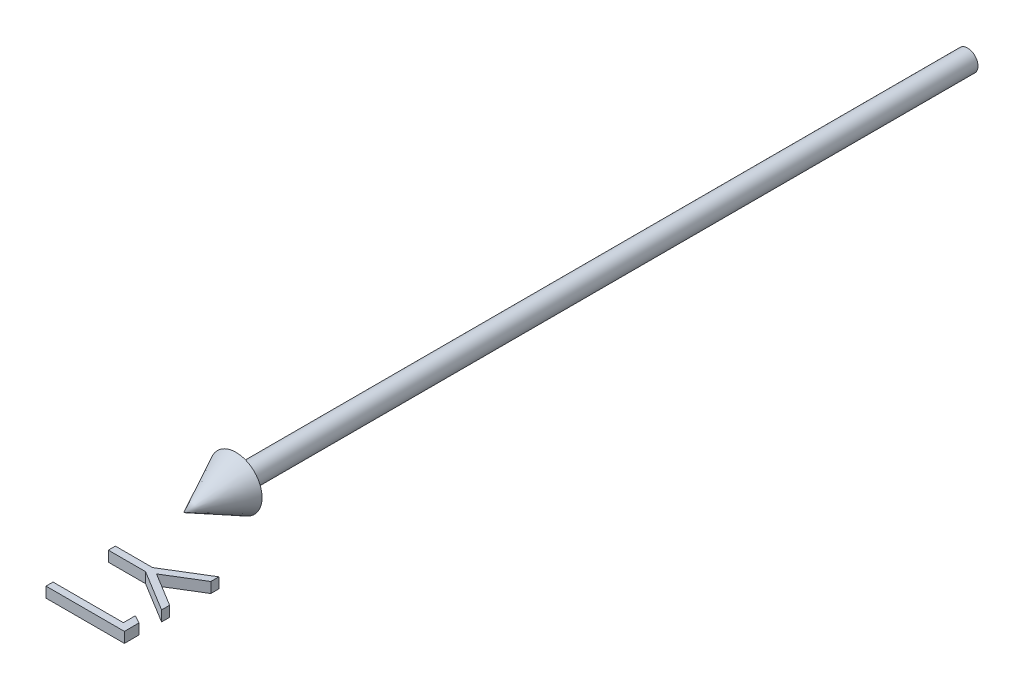
ISO-10303-21;
HEADER;
FILE_DESCRIPTION(('STEP AP214'),'2;1');
FILE_NAME('part.step','',(''),(''),'','','');
FILE_SCHEMA(('AUTOMOTIVE_DESIGN { 1 0 10303 214 1 1 1 1 }'));
ENDSEC;
DATA;
#1=APPLICATION_CONTEXT('core data for automotive mechanical design processes');
#2=APPLICATION_PROTOCOL_DEFINITION('international standard','automotive_design',2000,#1);
#3=PRODUCT_CONTEXT('',#1,'mechanical');
#4=PRODUCT('Part','Part','',(#3));
#5=PRODUCT_RELATED_PRODUCT_CATEGORY('part','',(#4));
#6=PRODUCT_DEFINITION_FORMATION('','',#4);
#7=PRODUCT_DEFINITION_CONTEXT('part definition',#1,'design');
#8=PRODUCT_DEFINITION('design','',#6,#7);
#9=PRODUCT_DEFINITION_SHAPE('','',#8);
#10=(LENGTH_UNIT() NAMED_UNIT(*) SI_UNIT(.MILLI.,.METRE.));
#11=(NAMED_UNIT(*) PLANE_ANGLE_UNIT() SI_UNIT($,.RADIAN.));
#12=(NAMED_UNIT(*) SI_UNIT($,.STERADIAN.) SOLID_ANGLE_UNIT());
#13=UNCERTAINTY_MEASURE_WITH_UNIT(LENGTH_MEASURE(1.E-05),#10,'distance_accuracy_value','');
#14=(GEOMETRIC_REPRESENTATION_CONTEXT(3) GLOBAL_UNCERTAINTY_ASSIGNED_CONTEXT((#13)) GLOBAL_UNIT_ASSIGNED_CONTEXT((#10,
#11,#12)) REPRESENTATION_CONTEXT('',''));
#15=CARTESIAN_POINT('',(0.,0.,0.));
#16=DIRECTION('',(0.,0.,1.));
#17=DIRECTION('',(1.,0.,0.));
#18=AXIS2_PLACEMENT_3D('',#15,#16,#17);
#19=CARTESIAN_POINT('',(13.4615384615385,1.,172.692307692308));
#20=DIRECTION('',(0.496686511837692,0.,-0.867930013859704));
#21=DIRECTION('',(-0.867930013859704,0.,-0.496686511837692));
#22=AXIS2_PLACEMENT_3D('',#19,#20,#21);
#23=PLANE('',#22);
#24=DIRECTION('',(0.,-1.,0.));
#25=VECTOR('',#24,1.);
#26=CARTESIAN_POINT('',(15.,1.,173.572716346154));
#27=LINE('',#26,#25);
#28=CARTESIAN_POINT('',(15.,1.,173.572716346154));
#29=VERTEX_POINT('',#28);
#30=CARTESIAN_POINT('',(15.,-1.,173.572716346154));
#31=VERTEX_POINT('',#30);
#32=EDGE_CURVE('E49',#29,#31,#27,.T.);
#33=ORIENTED_EDGE('',*,*,#32,.T.);
#34=DIRECTION('',(0.867930013859704,0.,0.496686511837692));
#35=VECTOR('',#34,1.);
#36=CARTESIAN_POINT('',(13.4615384615385,-1.,172.692307692308));
#37=LINE('',#36,#35);
#38=CARTESIAN_POINT('',(13.4615384615385,-1.,172.692307692308));
#39=VERTEX_POINT('',#38);
#40=EDGE_CURVE('E98',#39,#31,#37,.T.);
#41=ORIENTED_EDGE('',*,*,#40,.F.);
#42=DIRECTION('',(0.,-1.,0.));
#43=VECTOR('',#42,1.);
#44=CARTESIAN_POINT('',(13.4615384615385,1.,172.692307692308));
#45=LINE('',#44,#43);
#46=CARTESIAN_POINT('',(13.4615384615385,1.,172.692307692308));
#47=VERTEX_POINT('',#46);
#48=EDGE_CURVE('E12',#47,#39,#45,.T.);
#49=ORIENTED_EDGE('',*,*,#48,.F.);
#50=DIRECTION('',(0.867930013859704,0.,0.496686511837692));
#51=VECTOR('',#50,1.);
#52=CARTESIAN_POINT('',(13.4615384615385,1.,172.692307692308));
#53=LINE('',#52,#51);
#54=EDGE_CURVE('E99',#47,#29,#53,.T.);
#55=ORIENTED_EDGE('',*,*,#54,.T.);
#56=EDGE_LOOP('',(#33,#41,#49,#55));
#57=FACE_BOUND('',#56,.T.);
#58=ADVANCED_FACE('F46',(#57),#23,.T.);
#59=CARTESIAN_POINT('',(13.4615384615385,1.,175.));
#60=DIRECTION('',(-1.,0.,0.));
#61=DIRECTION('',(0.,0.,1.));
#62=AXIS2_PLACEMENT_3D('',#59,#60,#61);
#63=PLANE('',#62);
#64=ORIENTED_EDGE('',*,*,#48,.T.);
#65=DIRECTION('',(0.,0.,-1.));
#66=VECTOR('',#65,1.);
#67=CARTESIAN_POINT('',(13.4615384615385,-1.,175.));
#68=LINE('',#67,#66);
#69=CARTESIAN_POINT('',(13.4615384615385,-1.,175.));
#70=VERTEX_POINT('',#69);
#71=EDGE_CURVE('E116',#70,#39,#68,.T.);
#72=ORIENTED_EDGE('',*,*,#71,.F.);
#73=DIRECTION('',(0.,-1.,0.));
#74=VECTOR('',#73,1.);
#75=CARTESIAN_POINT('',(13.4615384615385,1.,175.));
#76=LINE('',#75,#74);
#77=CARTESIAN_POINT('',(13.4615384615385,1.,175.));
#78=VERTEX_POINT('',#77);
#79=EDGE_CURVE('E54',#78,#70,#76,.T.);
#80=ORIENTED_EDGE('',*,*,#79,.F.);
#81=DIRECTION('',(0.,0.,-1.));
#82=VECTOR('',#81,1.);
#83=CARTESIAN_POINT('',(13.4615384615385,1.,175.));
#84=LINE('',#83,#82);
#85=EDGE_CURVE('E104',#78,#47,#84,.T.);
#86=ORIENTED_EDGE('',*,*,#85,.T.);
#87=EDGE_LOOP('',(#64,#72,#80,#86));
#88=FACE_BOUND('',#87,.T.);
#89=ADVANCED_FACE('F156',(#88),#63,.T.);
#90=CARTESIAN_POINT('',(0.,1.,175.));
#91=DIRECTION('',(0.,0.,-1.));
#92=DIRECTION('',(-1.,0.,0.));
#93=AXIS2_PLACEMENT_3D('',#90,#91,#92);
#94=PLANE('',#93);
#95=ORIENTED_EDGE('',*,*,#79,.T.);
#96=DIRECTION('',(1.,0.,0.));
#97=VECTOR('',#96,1.);
#98=CARTESIAN_POINT('',(0.,-1.,175.));
#99=LINE('',#98,#97);
#100=CARTESIAN_POINT('',(0.,-1.,175.));
#101=VERTEX_POINT('',#100);
#102=EDGE_CURVE('E123',#101,#70,#99,.T.);
#103=ORIENTED_EDGE('',*,*,#102,.F.);
#104=DIRECTION('',(0.,-1.,0.));
#105=VECTOR('',#104,1.);
#106=CARTESIAN_POINT('',(0.,1.,175.));
#107=LINE('',#106,#105);
#108=CARTESIAN_POINT('',(0.,1.,175.));
#109=VERTEX_POINT('',#108);
#110=EDGE_CURVE('E139',#109,#101,#107,.T.);
#111=ORIENTED_EDGE('',*,*,#110,.F.);
#112=DIRECTION('',(1.,0.,0.));
#113=VECTOR('',#112,1.);
#114=CARTESIAN_POINT('',(0.,1.,175.));
#115=LINE('',#114,#113);
#116=EDGE_CURVE('E135',#109,#78,#115,.T.);
#117=ORIENTED_EDGE('',*,*,#116,.T.);
#118=EDGE_LOOP('',(#95,#103,#111,#117));
#119=FACE_BOUND('',#118,.T.);
#120=ADVANCED_FACE('F152',(#119),#94,.T.);
#121=CARTESIAN_POINT('',(0.,1.,176.346153846154));
#122=DIRECTION('',(-1.,0.,0.));
#123=DIRECTION('',(0.,0.,1.));
#124=AXIS2_PLACEMENT_3D('',#121,#122,#123);
#125=PLANE('',#124);
#126=ORIENTED_EDGE('',*,*,#110,.T.);
#127=DIRECTION('',(0.,0.,-1.));
#128=VECTOR('',#127,1.);
#129=CARTESIAN_POINT('',(0.,-1.,176.346153846154));
#130=LINE('',#129,#128);
#131=CARTESIAN_POINT('',(0.,-1.,176.346153846154));
#132=VERTEX_POINT('',#131);
#133=EDGE_CURVE('E120',#132,#101,#130,.T.);
#134=ORIENTED_EDGE('',*,*,#133,.F.);
#135=DIRECTION('',(0.,-1.,0.));
#136=VECTOR('',#135,1.);
#137=CARTESIAN_POINT('',(0.,1.,176.346153846154));
#138=LINE('',#137,#136);
#139=CARTESIAN_POINT('',(0.,1.,176.346153846154));
#140=VERTEX_POINT('',#139);
#141=EDGE_CURVE('E141',#140,#132,#138,.T.);
#142=ORIENTED_EDGE('',*,*,#141,.F.);
#143=DIRECTION('',(0.,0.,-1.));
#144=VECTOR('',#143,1.);
#145=CARTESIAN_POINT('',(0.,1.,176.346153846154));
#146=LINE('',#145,#144);
#147=EDGE_CURVE('E132',#140,#109,#146,.T.);
#148=ORIENTED_EDGE('',*,*,#147,.T.);
#149=EDGE_LOOP('',(#126,#134,#142,#148));
#150=FACE_BOUND('',#149,.T.);
#151=ADVANCED_FACE('F149',(#150),#125,.T.);
#152=CARTESIAN_POINT('',(15.,1.,176.346153846154));
#153=DIRECTION('',(0.,0.,1.));
#154=DIRECTION('',(1.,0.,0.));
#155=AXIS2_PLACEMENT_3D('',#152,#153,#154);
#156=PLANE('',#155);
#157=ORIENTED_EDGE('',*,*,#141,.T.);
#158=DIRECTION('',(-1.,0.,0.));
#159=VECTOR('',#158,1.);
#160=CARTESIAN_POINT('',(15.,-1.,176.346153846154));
#161=LINE('',#160,#159);
#162=CARTESIAN_POINT('',(15.,-1.,176.346153846154));
#163=VERTEX_POINT('',#162);
#164=EDGE_CURVE('E111',#163,#132,#161,.T.);
#165=ORIENTED_EDGE('',*,*,#164,.F.);
#166=DIRECTION('',(0.,-1.,0.));
#167=VECTOR('',#166,1.);
#168=CARTESIAN_POINT('',(15.,1.,176.346153846154));
#169=LINE('',#168,#167);
#170=CARTESIAN_POINT('',(15.,1.,176.346153846154));
#171=VERTEX_POINT('',#170);
#172=EDGE_CURVE('E103',#171,#163,#169,.T.);
#173=ORIENTED_EDGE('',*,*,#172,.F.);
#174=DIRECTION('',(-1.,0.,0.));
#175=VECTOR('',#174,1.);
#176=CARTESIAN_POINT('',(15.,1.,176.346153846154));
#177=LINE('',#176,#175);
#178=EDGE_CURVE('E129',#171,#140,#177,.T.);
#179=ORIENTED_EDGE('',*,*,#178,.T.);
#180=EDGE_LOOP('',(#157,#165,#173,#179));
#181=FACE_BOUND('',#180,.T.);
#182=ADVANCED_FACE('F143',(#181),#156,.T.);
#183=CARTESIAN_POINT('',(15.,1.,173.572716346154));
#184=DIRECTION('',(1.,0.,0.));
#185=DIRECTION('',(0.,0.,-1.));
#186=AXIS2_PLACEMENT_3D('',#183,#184,#185);
#187=PLANE('',#186);
#188=ORIENTED_EDGE('',*,*,#172,.T.);
#189=DIRECTION('',(0.,0.,1.));
#190=VECTOR('',#189,1.);
#191=CARTESIAN_POINT('',(15.,-1.,173.572716346154));
#192=LINE('',#191,#190);
#193=EDGE_CURVE('E106',#31,#163,#192,.T.);
#194=ORIENTED_EDGE('',*,*,#193,.F.);
#195=ORIENTED_EDGE('',*,*,#32,.F.);
#196=DIRECTION('',(0.,0.,1.));
#197=VECTOR('',#196,1.);
#198=CARTESIAN_POINT('',(15.,1.,173.572716346154));
#199=LINE('',#198,#197);
#200=EDGE_CURVE('E127',#29,#171,#199,.T.);
#201=ORIENTED_EDGE('',*,*,#200,.T.);
#202=EDGE_LOOP('',(#188,#194,#195,#201));
#203=FACE_BOUND('',#202,.T.);
#204=ADVANCED_FACE('F107',(#203),#187,.T.);
#205=CARTESIAN_POINT('',(0.,1.,0.));
#206=DIRECTION('',(0.,-1.,0.));
#207=DIRECTION('',(0.,0.,-1.));
#208=AXIS2_PLACEMENT_3D('',#205,#206,#207);
#209=PLANE('',#208);
#210=ORIENTED_EDGE('',*,*,#54,.F.);
#211=ORIENTED_EDGE('',*,*,#85,.F.);
#212=ORIENTED_EDGE('',*,*,#116,.F.);
#213=ORIENTED_EDGE('',*,*,#147,.F.);
#214=ORIENTED_EDGE('',*,*,#178,.F.);
#215=ORIENTED_EDGE('',*,*,#200,.F.);
#216=EDGE_LOOP('',(#210,#211,#212,#213,#214,#215));
#217=FACE_BOUND('',#216,.T.);
#218=ADVANCED_FACE('F155',(#217),#209,.F.);
#219=CARTESIAN_POINT('',(0.,-1.,0.));
#220=DIRECTION('',(0.,-1.,0.));
#221=DIRECTION('',(0.,0.,-1.));
#222=AXIS2_PLACEMENT_3D('',#219,#220,#221);
#223=PLANE('',#222);
#224=ORIENTED_EDGE('',*,*,#40,.T.);
#225=ORIENTED_EDGE('',*,*,#193,.T.);
#226=ORIENTED_EDGE('',*,*,#164,.T.);
#227=ORIENTED_EDGE('',*,*,#133,.T.);
#228=ORIENTED_EDGE('',*,*,#102,.T.);
#229=ORIENTED_EDGE('',*,*,#71,.T.);
#230=EDGE_LOOP('',(#224,#225,#226,#227,#228,#229));
#231=FACE_BOUND('',#230,.T.);
#232=ADVANCED_FACE('F114',(#231),#223,.T.);
#233=CLOSED_SHELL('',(#58,#89,#120,#151,#182,#204,#218,#232));
#234=MANIFOLD_SOLID_BREP('B2',#233);
#235=CARTESIAN_POINT('',(7.13040865384615,1.,163.076923076923));
#236=DIRECTION('',(-0.521331386880885,0.,-0.853354313900652));
#237=DIRECTION('',(-0.853354313900652,0.,0.521331386880885));
#238=AXIS2_PLACEMENT_3D('',#235,#236,#237);
#239=PLANE('',#238);
#240=DIRECTION('',(0.,-1.,0.));
#241=VECTOR('',#240,1.);
#242=CARTESIAN_POINT('',(15.,1.,158.269230769231));
#243=LINE('',#242,#241);
#244=CARTESIAN_POINT('',(15.,1.,158.269230769231));
#245=VERTEX_POINT('',#244);
#246=CARTESIAN_POINT('',(15.,-1.,158.269230769231));
#247=VERTEX_POINT('',#246);
#248=EDGE_CURVE('E234',#245,#247,#243,.T.);
#249=ORIENTED_EDGE('',*,*,#248,.T.);
#250=DIRECTION('',(0.853354313900652,0.,-0.521331386880885));
#251=VECTOR('',#250,1.);
#252=CARTESIAN_POINT('',(7.13040865384615,-1.,163.076923076923));
#253=LINE('',#252,#251);
#254=CARTESIAN_POINT('',(7.13040865384615,-1.,163.076923076923));
#255=VERTEX_POINT('',#254);
#256=EDGE_CURVE('E301',#255,#247,#253,.T.);
#257=ORIENTED_EDGE('',*,*,#256,.F.);
#258=DIRECTION('',(0.,-1.,0.));
#259=VECTOR('',#258,1.);
#260=CARTESIAN_POINT('',(7.13040865384615,1.,163.076923076923));
#261=LINE('',#260,#259);
#262=CARTESIAN_POINT('',(7.13040865384615,1.,163.076923076923));
#263=VERTEX_POINT('',#262);
#264=EDGE_CURVE('E44',#263,#255,#261,.T.);
#265=ORIENTED_EDGE('',*,*,#264,.F.);
#266=DIRECTION('',(0.853354313900652,0.,-0.521331386880885));
#267=VECTOR('',#266,1.);
#268=CARTESIAN_POINT('',(7.13040865384615,1.,163.076923076923));
#269=LINE('',#268,#267);
#270=EDGE_CURVE('E302',#263,#245,#269,.T.);
#271=ORIENTED_EDGE('',*,*,#270,.T.);
#272=EDGE_LOOP('',(#249,#257,#265,#271));
#273=FACE_BOUND('',#272,.T.);
#274=ADVANCED_FACE('F231',(#273),#239,.T.);
#275=CARTESIAN_POINT('',(0.,1.,163.076923076923));
#276=DIRECTION('',(0.,0.,-1.));
#277=DIRECTION('',(-1.,0.,0.));
#278=AXIS2_PLACEMENT_3D('',#275,#276,#277);
#279=PLANE('',#278);
#280=ORIENTED_EDGE('',*,*,#264,.T.);
#281=DIRECTION('',(1.,0.,0.));
#282=VECTOR('',#281,1.);
#283=CARTESIAN_POINT('',(0.,-1.,163.076923076923));
#284=LINE('',#283,#282);
#285=CARTESIAN_POINT('',(0.,-1.,163.076923076923));
#286=VERTEX_POINT('',#285);
#287=EDGE_CURVE('E319',#286,#255,#284,.T.);
#288=ORIENTED_EDGE('',*,*,#287,.F.);
#289=DIRECTION('',(0.,-1.,0.));
#290=VECTOR('',#289,1.);
#291=CARTESIAN_POINT('',(0.,1.,163.076923076923));
#292=LINE('',#291,#290);
#293=CARTESIAN_POINT('',(0.,1.,163.076923076923));
#294=VERTEX_POINT('',#293);
#295=EDGE_CURVE('E239',#294,#286,#292,.T.);
#296=ORIENTED_EDGE('',*,*,#295,.F.);
#297=DIRECTION('',(1.,0.,0.));
#298=VECTOR('',#297,1.);
#299=CARTESIAN_POINT('',(0.,1.,163.076923076923));
#300=LINE('',#299,#298);
#301=EDGE_CURVE('E307',#294,#263,#300,.T.);
#302=ORIENTED_EDGE('',*,*,#301,.T.);
#303=EDGE_LOOP('',(#280,#288,#296,#302));
#304=FACE_BOUND('',#303,.T.);
#305=ADVANCED_FACE('F395',(#304),#279,.T.);
#306=CARTESIAN_POINT('',(0.,1.,164.423076923077));
#307=DIRECTION('',(-1.,0.,0.));
#308=DIRECTION('',(0.,0.,1.));
#309=AXIS2_PLACEMENT_3D('',#306,#307,#308);
#310=PLANE('',#309);
#311=ORIENTED_EDGE('',*,*,#295,.T.);
#312=DIRECTION('',(0.,0.,-1.));
#313=VECTOR('',#312,1.);
#314=CARTESIAN_POINT('',(0.,-1.,164.423076923077));
#315=LINE('',#314,#313);
#316=CARTESIAN_POINT('',(0.,-1.,164.423076923077));
#317=VERTEX_POINT('',#316);
#318=EDGE_CURVE('E335',#317,#286,#315,.T.);
#319=ORIENTED_EDGE('',*,*,#318,.F.);
#320=DIRECTION('',(0.,-1.,0.));
#321=VECTOR('',#320,1.);
#322=CARTESIAN_POINT('',(0.,1.,164.423076923077));
#323=LINE('',#322,#321);
#324=CARTESIAN_POINT('',(0.,1.,164.423076923077));
#325=VERTEX_POINT('',#324);
#326=EDGE_CURVE('E360',#325,#317,#323,.T.);
#327=ORIENTED_EDGE('',*,*,#326,.F.);
#328=DIRECTION('',(0.,0.,-1.));
#329=VECTOR('',#328,1.);
#330=CARTESIAN_POINT('',(0.,1.,164.423076923077));
#331=LINE('',#330,#329);
#332=EDGE_CURVE('E356',#325,#294,#331,.T.);
#333=ORIENTED_EDGE('',*,*,#332,.T.);
#334=EDGE_LOOP('',(#311,#319,#327,#333));
#335=FACE_BOUND('',#334,.T.);
#336=ADVANCED_FACE('F393',(#335),#310,.T.);
#337=CARTESIAN_POINT('',(7.13040865384615,1.,164.423076923077));
#338=DIRECTION('',(0.,0.,1.));
#339=DIRECTION('',(1.,0.,0.));
#340=AXIS2_PLACEMENT_3D('',#337,#338,#339);
#341=PLANE('',#340);
#342=ORIENTED_EDGE('',*,*,#326,.T.);
#343=DIRECTION('',(-1.,0.,0.));
#344=VECTOR('',#343,1.);
#345=CARTESIAN_POINT('',(7.13040865384615,-1.,164.423076923077));
#346=LINE('',#345,#344);
#347=CARTESIAN_POINT('',(7.13040865384615,-1.,164.423076923077));
#348=VERTEX_POINT('',#347);
#349=EDGE_CURVE('E332',#348,#317,#346,.T.);
#350=ORIENTED_EDGE('',*,*,#349,.F.);
#351=DIRECTION('',(0.,-1.,0.));
#352=VECTOR('',#351,1.);
#353=CARTESIAN_POINT('',(7.13040865384615,1.,164.423076923077));
#354=LINE('',#353,#352);
#355=CARTESIAN_POINT('',(7.13040865384615,1.,164.423076923077));
#356=VERTEX_POINT('',#355);
#357=EDGE_CURVE('E362',#356,#348,#354,.T.);
#358=ORIENTED_EDGE('',*,*,#357,.F.);
#359=DIRECTION('',(-1.,0.,0.));
#360=VECTOR('',#359,1.);
#361=CARTESIAN_POINT('',(7.13040865384615,1.,164.423076923077));
#362=LINE('',#361,#360);
#363=EDGE_CURVE('E353',#356,#325,#362,.T.);
#364=ORIENTED_EDGE('',*,*,#363,.T.);
#365=EDGE_LOOP('',(#342,#350,#358,#364));
#366=FACE_BOUND('',#365,.T.);
#367=ADVANCED_FACE('F391',(#366),#341,.T.);
#368=CARTESIAN_POINT('',(15.,1.,169.230769230769));
#369=DIRECTION('',(-0.521331386880888,0.,0.853354313900651));
#370=DIRECTION('',(0.853354313900651,0.,0.521331386880888));
#371=AXIS2_PLACEMENT_3D('',#368,#369,#370);
#372=PLANE('',#371);
#373=ORIENTED_EDGE('',*,*,#357,.T.);
#374=DIRECTION('',(-0.853354313900651,0.,-0.521331386880888));
#375=VECTOR('',#374,1.);
#376=CARTESIAN_POINT('',(15.,-1.,169.230769230769));
#377=LINE('',#376,#375);
#378=CARTESIAN_POINT('',(15.,-1.,169.230769230769));
#379=VERTEX_POINT('',#378);
#380=EDGE_CURVE('E329',#379,#348,#377,.T.);
#381=ORIENTED_EDGE('',*,*,#380,.F.);
#382=DIRECTION('',(0.,-1.,0.));
#383=VECTOR('',#382,1.);
#384=CARTESIAN_POINT('',(15.,1.,169.230769230769));
#385=LINE('',#384,#383);
#386=CARTESIAN_POINT('',(15.,1.,169.230769230769));
#387=VERTEX_POINT('',#386);
#388=EDGE_CURVE('E364',#387,#379,#385,.T.);
#389=ORIENTED_EDGE('',*,*,#388,.F.);
#390=DIRECTION('',(-0.853354313900651,0.,-0.521331386880888));
#391=VECTOR('',#390,1.);
#392=CARTESIAN_POINT('',(15.,1.,169.230769230769));
#393=LINE('',#392,#391);
#394=EDGE_CURVE('E350',#387,#356,#393,.T.);
#395=ORIENTED_EDGE('',*,*,#394,.T.);
#396=EDGE_LOOP('',(#373,#381,#389,#395));
#397=FACE_BOUND('',#396,.T.);
#398=ADVANCED_FACE('F386',(#397),#372,.T.);
#399=CARTESIAN_POINT('',(15.,1.,167.689302884615));
#400=DIRECTION('',(1.,0.,0.));
#401=DIRECTION('',(0.,0.,-1.));
#402=AXIS2_PLACEMENT_3D('',#399,#400,#401);
#403=PLANE('',#402);
#404=ORIENTED_EDGE('',*,*,#388,.T.);
#405=DIRECTION('',(0.,0.,1.));
#406=VECTOR('',#405,1.);
#407=CARTESIAN_POINT('',(15.,-1.,167.689302884615));
#408=LINE('',#407,#406);
#409=CARTESIAN_POINT('',(15.,-1.,167.689302884615));
#410=VERTEX_POINT('',#409);
#411=EDGE_CURVE('E326',#410,#379,#408,.T.);
#412=ORIENTED_EDGE('',*,*,#411,.F.);
#413=DIRECTION('',(0.,-1.,0.));
#414=VECTOR('',#413,1.);
#415=CARTESIAN_POINT('',(15.,1.,167.689302884615));
#416=LINE('',#415,#414);
#417=CARTESIAN_POINT('',(15.,1.,167.689302884615));
#418=VERTEX_POINT('',#417);
#419=EDGE_CURVE('E366',#418,#410,#416,.T.);
#420=ORIENTED_EDGE('',*,*,#419,.F.);
#421=DIRECTION('',(0.,0.,1.));
#422=VECTOR('',#421,1.);
#423=CARTESIAN_POINT('',(15.,1.,167.689302884615));
#424=LINE('',#423,#422);
#425=EDGE_CURVE('E347',#418,#387,#424,.T.);
#426=ORIENTED_EDGE('',*,*,#425,.T.);
#427=EDGE_LOOP('',(#404,#412,#420,#426));
#428=FACE_BOUND('',#427,.T.);
#429=ADVANCED_FACE('F379',(#428),#403,.T.);
#430=CARTESIAN_POINT('',(8.5546875,1.,163.753004807692));
#431=DIRECTION('',(0.52120858483258,0.,-0.853429324019757));
#432=DIRECTION('',(-0.853429324019757,0.,-0.52120858483258));
#433=AXIS2_PLACEMENT_3D('',#430,#431,#432);
#434=PLANE('',#433);
#435=ORIENTED_EDGE('',*,*,#419,.T.);
#436=DIRECTION('',(0.853429324019757,0.,0.52120858483258));
#437=VECTOR('',#436,1.);
#438=CARTESIAN_POINT('',(8.5546875,-1.,163.753004807692));
#439=LINE('',#438,#437);
#440=CARTESIAN_POINT('',(8.5546875,-1.,163.753004807692));
#441=VERTEX_POINT('',#440);
#442=EDGE_CURVE('E323',#441,#410,#439,.T.);
#443=ORIENTED_EDGE('',*,*,#442,.F.);
#444=DIRECTION('',(0.,-1.,0.));
#445=VECTOR('',#444,1.);
#446=CARTESIAN_POINT('',(8.5546875,1.,163.753004807692));
#447=LINE('',#446,#445);
#448=CARTESIAN_POINT('',(8.5546875,1.,163.753004807692));
#449=VERTEX_POINT('',#448);
#450=EDGE_CURVE('E368',#449,#441,#447,.T.);
#451=ORIENTED_EDGE('',*,*,#450,.F.);
#452=DIRECTION('',(0.853429324019757,0.,0.52120858483258));
#453=VECTOR('',#452,1.);
#454=CARTESIAN_POINT('',(8.5546875,1.,163.753004807692));
#455=LINE('',#454,#453);
#456=EDGE_CURVE('E344',#449,#418,#455,.T.);
#457=ORIENTED_EDGE('',*,*,#456,.T.);
#458=EDGE_LOOP('',(#435,#443,#451,#457));
#459=FACE_BOUND('',#458,.T.);
#460=ADVANCED_FACE('F376',(#459),#434,.T.);
#461=CARTESIAN_POINT('',(15.,1.,159.810697115385));
#462=DIRECTION('',(0.521787793651244,0.,0.853075318126463));
#463=DIRECTION('',(0.853075318126463,0.,-0.521787793651244));
#464=AXIS2_PLACEMENT_3D('',#461,#462,#463);
#465=PLANE('',#464);
#466=ORIENTED_EDGE('',*,*,#450,.T.);
#467=DIRECTION('',(-0.853075318126463,0.,0.521787793651244));
#468=VECTOR('',#467,1.);
#469=CARTESIAN_POINT('',(15.,-1.,159.810697115385));
#470=LINE('',#469,#468);
#471=CARTESIAN_POINT('',(15.,-1.,159.810697115385));
#472=VERTEX_POINT('',#471);
#473=EDGE_CURVE('E314',#472,#441,#470,.T.);
#474=ORIENTED_EDGE('',*,*,#473,.F.);
#475=DIRECTION('',(0.,-1.,0.));
#476=VECTOR('',#475,1.);
#477=CARTESIAN_POINT('',(15.,1.,159.810697115385));
#478=LINE('',#477,#476);
#479=CARTESIAN_POINT('',(15.,1.,159.810697115385));
#480=VERTEX_POINT('',#479);
#481=EDGE_CURVE('E306',#480,#472,#478,.T.);
#482=ORIENTED_EDGE('',*,*,#481,.F.);
#483=DIRECTION('',(-0.853075318126463,0.,0.521787793651244));
#484=VECTOR('',#483,1.);
#485=CARTESIAN_POINT('',(15.,1.,159.810697115385));
#486=LINE('',#485,#484);
#487=EDGE_CURVE('E341',#480,#449,#486,.T.);
#488=ORIENTED_EDGE('',*,*,#487,.T.);
#489=EDGE_LOOP('',(#466,#474,#482,#488));
#490=FACE_BOUND('',#489,.T.);
#491=ADVANCED_FACE('F370',(#490),#465,.T.);
#492=CARTESIAN_POINT('',(15.,1.,158.269230769231));
#493=DIRECTION('',(1.,0.,0.));
#494=DIRECTION('',(0.,0.,-1.));
#495=AXIS2_PLACEMENT_3D('',#492,#493,#494);
#496=PLANE('',#495);
#497=ORIENTED_EDGE('',*,*,#481,.T.);
#498=DIRECTION('',(0.,0.,1.));
#499=VECTOR('',#498,1.);
#500=CARTESIAN_POINT('',(15.,-1.,158.269230769231));
#501=LINE('',#500,#499);
#502=EDGE_CURVE('E309',#247,#472,#501,.T.);
#503=ORIENTED_EDGE('',*,*,#502,.F.);
#504=ORIENTED_EDGE('',*,*,#248,.F.);
#505=DIRECTION('',(0.,0.,1.));
#506=VECTOR('',#505,1.);
#507=CARTESIAN_POINT('',(15.,1.,158.269230769231));
#508=LINE('',#507,#506);
#509=EDGE_CURVE('E339',#245,#480,#508,.T.);
#510=ORIENTED_EDGE('',*,*,#509,.T.);
#511=EDGE_LOOP('',(#497,#503,#504,#510));
#512=FACE_BOUND('',#511,.T.);
#513=ADVANCED_FACE('F310',(#512),#496,.T.);
#514=CARTESIAN_POINT('',(0.,1.,0.));
#515=DIRECTION('',(0.,1.,0.));
#516=DIRECTION('',(0.,0.,1.));
#517=AXIS2_PLACEMENT_3D('',#514,#515,#516);
#518=PLANE('',#517);
#519=ORIENTED_EDGE('',*,*,#270,.F.);
#520=ORIENTED_EDGE('',*,*,#301,.F.);
#521=ORIENTED_EDGE('',*,*,#332,.F.);
#522=ORIENTED_EDGE('',*,*,#363,.F.);
#523=ORIENTED_EDGE('',*,*,#394,.F.);
#524=ORIENTED_EDGE('',*,*,#425,.F.);
#525=ORIENTED_EDGE('',*,*,#456,.F.);
#526=ORIENTED_EDGE('',*,*,#487,.F.);
#527=ORIENTED_EDGE('',*,*,#509,.F.);
#528=EDGE_LOOP('',(#519,#520,#521,#522,#523,#524,#525,#526,#527));
#529=FACE_BOUND('',#528,.T.);
#530=ADVANCED_FACE('F382',(#529),#518,.T.);
#531=CARTESIAN_POINT('',(0.,-1.,0.));
#532=DIRECTION('',(0.,1.,0.));
#533=DIRECTION('',(0.,0.,1.));
#534=AXIS2_PLACEMENT_3D('',#531,#532,#533);
#535=PLANE('',#534);
#536=ORIENTED_EDGE('',*,*,#256,.T.);
#537=ORIENTED_EDGE('',*,*,#502,.T.);
#538=ORIENTED_EDGE('',*,*,#473,.T.);
#539=ORIENTED_EDGE('',*,*,#442,.T.);
#540=ORIENTED_EDGE('',*,*,#411,.T.);
#541=ORIENTED_EDGE('',*,*,#380,.T.);
#542=ORIENTED_EDGE('',*,*,#349,.T.);
#543=ORIENTED_EDGE('',*,*,#318,.T.);
#544=ORIENTED_EDGE('',*,*,#287,.T.);
#545=EDGE_LOOP('',(#536,#537,#538,#539,#540,#541,#542,#543,#544));
#546=FACE_BOUND('',#545,.T.);
#547=ADVANCED_FACE('F317',(#546),#535,.F.);
#548=CLOSED_SHELL('',(#274,#305,#336,#367,#398,#429,#460,#491,#513,#530,#547));
#549=MANIFOLD_SOLID_BREP('B6',#548);
#550=CARTESIAN_POINT('',(2.,0.,0.));
#551=DIRECTION('',(0.,0.,1.));
#552=DIRECTION('',(1.,0.,0.));
#553=AXIS2_PLACEMENT_3D('',#550,#551,#552);
#554=PLANE('',#553);
#555=CARTESIAN_POINT('',(0.,0.,0.));
#556=DIRECTION('',(0.,0.,-1.));
#557=DIRECTION('',(-1.,0.,0.));
#558=AXIS2_PLACEMENT_3D('',#555,#556,#557);
#559=CIRCLE('',#558,2.);
#560=CARTESIAN_POINT('',(-2.,0.,0.));
#561=VERTEX_POINT('',#560);
#562=EDGE_CURVE('E229',#561,#561,#559,.T.);
#563=ORIENTED_EDGE('',*,*,#562,.T.);
#564=EDGE_LOOP('',(#563));
#565=FACE_BOUND('',#564,.T.);
#566=ADVANCED_FACE('F485',(#565),#554,.F.);
#567=CARTESIAN_POINT('',(0.,0.,-41.9499520246458));
#568=DIRECTION('',(0.,0.,-1.));
#569=DIRECTION('',(-1.,0.,0.));
#570=AXIS2_PLACEMENT_3D('',#567,#568,#569);
#571=CYLINDRICAL_SURFACE('',#570,2.);
#572=ORIENTED_EDGE('',*,*,#562,.F.);
#573=EDGE_LOOP('',(#572));
#574=FACE_BOUND('',#573,.T.);
#575=CARTESIAN_POINT('',(0.,0.,140.));
#576=DIRECTION('',(0.,0.,-1.));
#577=DIRECTION('',(-1.,0.,0.));
#578=AXIS2_PLACEMENT_3D('',#575,#576,#577);
#579=CIRCLE('',#578,2.);
#580=CARTESIAN_POINT('',(-2.,0.,140.));
#581=VERTEX_POINT('',#580);
#582=EDGE_CURVE('E491',#581,#581,#579,.T.);
#583=ORIENTED_EDGE('',*,*,#582,.T.);
#584=EDGE_LOOP('',(#583));
#585=FACE_BOUND('',#584,.T.);
#586=ADVANCED_FACE('F502',(#574,#585),#571,.T.);
#587=CARTESIAN_POINT('',(5.00000000000002,0.,140.));
#588=DIRECTION('',(0.,0.,1.));
#589=DIRECTION('',(1.,0.,0.));
#590=AXIS2_PLACEMENT_3D('',#587,#588,#589);
#591=PLANE('',#590);
#592=ORIENTED_EDGE('',*,*,#582,.F.);
#593=EDGE_LOOP('',(#592));
#594=FACE_BOUND('',#593,.T.);
#595=CARTESIAN_POINT('',(0.,0.,140.));
#596=DIRECTION('',(0.,0.,-1.));
#597=DIRECTION('',(-1.,0.,0.));
#598=AXIS2_PLACEMENT_3D('',#595,#596,#597);
#599=CIRCLE('',#598,5.00000000000002);
#600=CARTESIAN_POINT('',(-5.00000000000002,0.,140.));
#601=VERTEX_POINT('',#600);
#602=EDGE_CURVE('E516',#601,#601,#599,.T.);
#603=ORIENTED_EDGE('',*,*,#602,.T.);
#604=EDGE_LOOP('',(#603));
#605=FACE_BOUND('',#604,.T.);
#606=ADVANCED_FACE('F496',(#594,#605),#591,.F.);
#607=CARTESIAN_POINT('',(0.,0.,150.));
#608=DIRECTION('',(0.,0.,-1.));
#609=DIRECTION('',(-1.,0.,0.));
#610=AXIS2_PLACEMENT_3D('',#607,#608,#609);
#611=CONICAL_SURFACE('',#610,0.,0.463647609000806);
#612=ORIENTED_EDGE('',*,*,#602,.F.);
#613=EDGE_LOOP('',(#612));
#614=FACE_BOUND('',#613,.T.);
#615=CARTESIAN_POINT('',(0.,0.,150.));
#616=VERTEX_POINT('',#615);
#617=VERTEX_LOOP('',#616);
#618=FACE_BOUND('',#617,.T.);
#619=ADVANCED_FACE('F494',(#614,#618),#611,.T.);
#620=CLOSED_SHELL('',(#566,#586,#606,#619));
#621=MANIFOLD_SOLID_BREP('B38',#620);
#622=ADVANCED_BREP_SHAPE_REPRESENTATION('',(#18,#234,#549,#621),#14);
#623=SHAPE_DEFINITION_REPRESENTATION(#9,#622);
ENDSEC;
END-ISO-10303-21;
